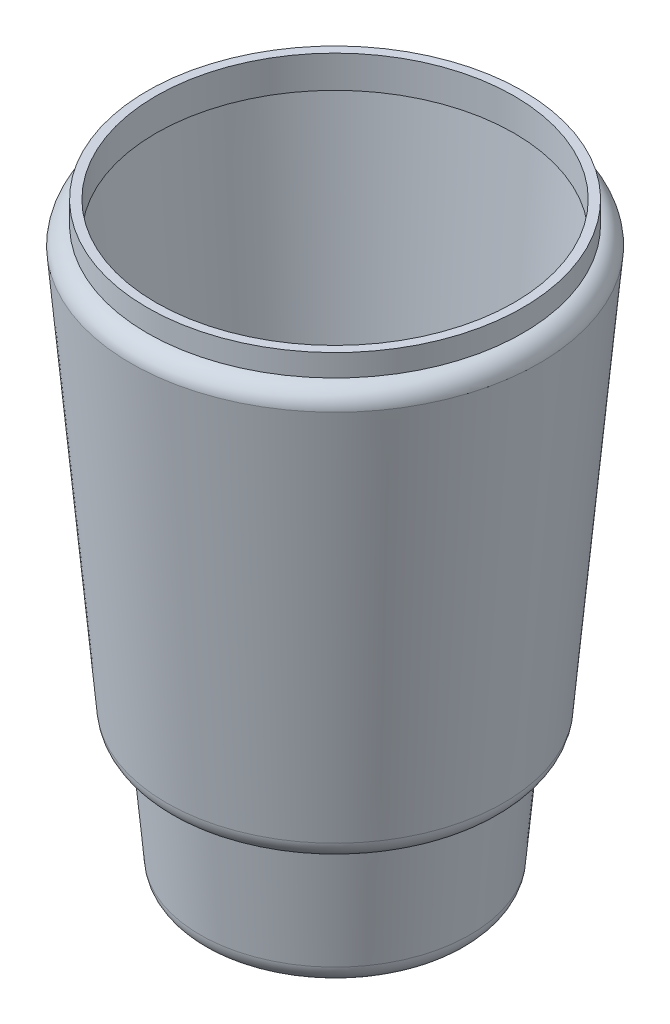
ISO-10303-21;
HEADER;
FILE_DESCRIPTION(('STEP AP214'),'2;1');
FILE_NAME('part.step','',(''),(''),'','','');
FILE_SCHEMA(('AUTOMOTIVE_DESIGN { 1 0 10303 214 1 1 1 1 }'));
ENDSEC;
DATA;
#1=APPLICATION_CONTEXT('core data for automotive mechanical design processes');
#2=APPLICATION_PROTOCOL_DEFINITION('international standard','automotive_design',2000,#1);
#3=PRODUCT_CONTEXT('',#1,'mechanical');
#4=PRODUCT('Part','Part','',(#3));
#5=PRODUCT_RELATED_PRODUCT_CATEGORY('part','',(#4));
#6=PRODUCT_DEFINITION_FORMATION('','',#4);
#7=PRODUCT_DEFINITION_CONTEXT('part definition',#1,'design');
#8=PRODUCT_DEFINITION('design','',#6,#7);
#9=PRODUCT_DEFINITION_SHAPE('','',#8);
#10=(LENGTH_UNIT() NAMED_UNIT(*) SI_UNIT(.MILLI.,.METRE.));
#11=(NAMED_UNIT(*) PLANE_ANGLE_UNIT() SI_UNIT($,.RADIAN.));
#12=(NAMED_UNIT(*) SI_UNIT($,.STERADIAN.) SOLID_ANGLE_UNIT());
#13=UNCERTAINTY_MEASURE_WITH_UNIT(LENGTH_MEASURE(1.E-05),#10,'distance_accuracy_value','');
#14=(GEOMETRIC_REPRESENTATION_CONTEXT(3) GLOBAL_UNCERTAINTY_ASSIGNED_CONTEXT((#13)) GLOBAL_UNIT_ASSIGNED_CONTEXT((#10,
#11,#12)) REPRESENTATION_CONTEXT('',''));
#15=CARTESIAN_POINT('',(0.,0.,0.));
#16=DIRECTION('',(0.,0.,1.));
#17=DIRECTION('',(1.,0.,0.));
#18=AXIS2_PLACEMENT_3D('',#15,#16,#17);
#19=CARTESIAN_POINT('',(0.,135.,-43.));
#20=DIRECTION('',(0.,1.,0.));
#21=DIRECTION('',(0.,0.,1.));
#22=AXIS2_PLACEMENT_3D('',#19,#20,#21);
#23=PLANE('',#22);
#24=CARTESIAN_POINT('',(0.,135.,0.));
#25=DIRECTION('',(0.,1.,0.));
#26=DIRECTION('',(0.,0.,1.));
#27=AXIS2_PLACEMENT_3D('',#24,#25,#26);
#28=CIRCLE('',#27,41.);
#29=CARTESIAN_POINT('',(0.,135.,41.));
#30=VERTEX_POINT('',#29);
#31=EDGE_CURVE('E88',#30,#30,#28,.F.);
#32=ORIENTED_EDGE('',*,*,#31,.T.);
#33=EDGE_LOOP('',(#32));
#34=FACE_BOUND('',#33,.T.);
#35=CARTESIAN_POINT('',(0.,135.,0.));
#36=DIRECTION('',(0.,-1.,0.));
#37=DIRECTION('',(0.,0.,-1.));
#38=AXIS2_PLACEMENT_3D('',#35,#36,#37);
#39=CIRCLE('',#38,43.);
#40=CARTESIAN_POINT('',(0.,135.,-43.));
#41=VERTEX_POINT('',#40);
#42=EDGE_CURVE('E10',#41,#41,#39,.T.);
#43=ORIENTED_EDGE('',*,*,#42,.F.);
#44=EDGE_LOOP('',(#43));
#45=FACE_BOUND('',#44,.T.);
#46=ADVANCED_FACE('F49',(#34,#45),#23,.T.);
#47=CARTESIAN_POINT('',(0.,0.,0.));
#48=DIRECTION('',(0.,-1.,0.));
#49=DIRECTION('',(0.,0.,-1.));
#50=AXIS2_PLACEMENT_3D('',#47,#48,#49);
#51=CYLINDRICAL_SURFACE('',#50,43.);
#52=ORIENTED_EDGE('',*,*,#42,.T.);
#53=EDGE_LOOP('',(#52));
#54=FACE_BOUND('',#53,.T.);
#55=CARTESIAN_POINT('',(0.,129.952018505343,0.));
#56=DIRECTION('',(0.,-1.,0.));
#57=DIRECTION('',(0.,0.,-1.));
#58=AXIS2_PLACEMENT_3D('',#55,#56,#57);
#59=CIRCLE('',#58,43.);
#60=CARTESIAN_POINT('',(0.,129.952018505343,-43.));
#61=VERTEX_POINT('',#60);
#62=EDGE_CURVE('E56',#61,#61,#59,.T.);
#63=ORIENTED_EDGE('',*,*,#62,.F.);
#64=EDGE_LOOP('',(#63));
#65=FACE_BOUND('',#64,.T.);
#66=ADVANCED_FACE('F166',(#54,#65),#51,.T.);
#67=CARTESIAN_POINT('',(0.,125.579924599252,0.));
#68=DIRECTION('',(0.,-1.,0.));
#69=DIRECTION('',(0.,0.,-1.));
#70=AXIS2_PLACEMENT_3D('',#67,#68,#69);
#71=TOROIDAL_SURFACE('',#70,42.312532080804,4.42581261053871);
#72=ORIENTED_EDGE('',*,*,#62,.T.);
#73=EDGE_LOOP('',(#72));
#74=FACE_BOUND('',#73,.T.);
#75=CARTESIAN_POINT('',(0.,125.805203793381,0.));
#76=DIRECTION('',(0.,-1.,0.));
#77=DIRECTION('',(0.,0.,-1.));
#78=AXIS2_PLACEMENT_3D('',#75,#76,#77);
#79=CIRCLE('',#78,46.7326074815519);
#80=CARTESIAN_POINT('',(0.,125.805203793381,-46.7326074815519));
#81=VERTEX_POINT('',#80);
#82=EDGE_CURVE('E61',#81,#81,#79,.T.);
#83=ORIENTED_EDGE('',*,*,#82,.F.);
#84=EDGE_LOOP('',(#83));
#85=FACE_BOUND('',#84,.T.);
#86=ADVANCED_FACE('F171',(#74,#85),#71,.T.);
#87=CARTESIAN_POINT('',(0.,34.5553403101275,0.));
#88=DIRECTION('',(0.,1.,0.));
#89=DIRECTION('',(0.,0.,1.));
#90=AXIS2_PLACEMENT_3D('',#87,#88,#89);
#91=CONICAL_SURFACE('',#90,38.5852982419757,0.0890495826344976);
#92=ORIENTED_EDGE('',*,*,#82,.T.);
#93=EDGE_LOOP('',(#92));
#94=FACE_BOUND('',#93,.T.);
#95=CARTESIAN_POINT('',(0.,34.5553403101275,0.));
#96=DIRECTION('',(0.,-1.,0.));
#97=DIRECTION('',(0.,0.,-1.));
#98=AXIS2_PLACEMENT_3D('',#95,#96,#97);
#99=CIRCLE('',#98,38.5852982419757);
#100=CARTESIAN_POINT('',(0.,34.5553403101275,-38.5852982419757));
#101=VERTEX_POINT('',#100);
#102=EDGE_CURVE('E66',#101,#101,#99,.T.);
#103=ORIENTED_EDGE('',*,*,#102,.F.);
#104=EDGE_LOOP('',(#103));
#105=FACE_BOUND('',#104,.T.);
#106=ADVANCED_FACE('F201',(#94,#105),#91,.T.);
#107=CARTESIAN_POINT('',(0.,35.,0.));
#108=DIRECTION('',(0.,-1.,0.));
#109=DIRECTION('',(0.,0.,-1.));
#110=AXIS2_PLACEMENT_3D('',#107,#108,#109);
#111=TOROIDAL_SURFACE('',#110,33.6051097154034,5.);
#112=ORIENTED_EDGE('',*,*,#102,.T.);
#113=EDGE_LOOP('',(#112));
#114=FACE_BOUND('',#113,.T.);
#115=CARTESIAN_POINT('',(0.,30.,0.));
#116=DIRECTION('',(0.,-1.,0.));
#117=DIRECTION('',(0.,0.,-1.));
#118=AXIS2_PLACEMENT_3D('',#115,#116,#117);
#119=CIRCLE('',#118,33.6051097154033);
#120=CARTESIAN_POINT('',(0.,30.,-33.6051097154033));
#121=VERTEX_POINT('',#120);
#122=EDGE_CURVE('E72',#121,#121,#119,.T.);
#123=ORIENTED_EDGE('',*,*,#122,.F.);
#124=EDGE_LOOP('',(#123));
#125=FACE_BOUND('',#124,.T.);
#126=ADVANCED_FACE('F197',(#114,#125),#111,.T.);
#127=CARTESIAN_POINT('',(0.,30.,-33.1785714285714));
#128=DIRECTION('',(0.,-1.,0.));
#129=DIRECTION('',(0.,0.,-1.));
#130=AXIS2_PLACEMENT_3D('',#127,#128,#129);
#131=PLANE('',#130);
#132=ORIENTED_EDGE('',*,*,#122,.T.);
#133=EDGE_LOOP('',(#132));
#134=FACE_BOUND('',#133,.T.);
#135=CARTESIAN_POINT('',(0.,30.,0.));
#136=DIRECTION('',(0.,-1.,0.));
#137=DIRECTION('',(0.,0.,-1.));
#138=AXIS2_PLACEMENT_3D('',#135,#136,#137);
#139=CIRCLE('',#138,33.1785714285714);
#140=CARTESIAN_POINT('',(0.,30.,-33.1785714285714));
#141=VERTEX_POINT('',#140);
#142=EDGE_CURVE('E76',#141,#141,#139,.T.);
#143=ORIENTED_EDGE('',*,*,#142,.F.);
#144=EDGE_LOOP('',(#143));
#145=FACE_BOUND('',#144,.T.);
#146=ADVANCED_FACE('F193',(#134,#145),#131,.T.);
#147=CARTESIAN_POINT('',(0.,4.5553403101275,0.));
#148=DIRECTION('',(0.,1.,0.));
#149=DIRECTION('',(0.,0.,1.));
#150=AXIS2_PLACEMENT_3D('',#147,#148,#149);
#151=CONICAL_SURFACE('',#150,30.9067268134042,0.0890495826344977);
#152=ORIENTED_EDGE('',*,*,#142,.T.);
#153=EDGE_LOOP('',(#152));
#154=FACE_BOUND('',#153,.T.);
#155=CARTESIAN_POINT('',(0.,4.5553403101275,0.));
#156=DIRECTION('',(0.,-1.,0.));
#157=DIRECTION('',(0.,0.,-1.));
#158=AXIS2_PLACEMENT_3D('',#155,#156,#157);
#159=CIRCLE('',#158,30.9067268134042);
#160=CARTESIAN_POINT('',(0.,4.5553403101275,-30.9067268134042));
#161=VERTEX_POINT('',#160);
#162=EDGE_CURVE('E80',#161,#161,#159,.T.);
#163=ORIENTED_EDGE('',*,*,#162,.F.);
#164=EDGE_LOOP('',(#163));
#165=FACE_BOUND('',#164,.T.);
#166=ADVANCED_FACE('F187',(#154,#165),#151,.T.);
#167=CARTESIAN_POINT('',(0.,5.,0.));
#168=DIRECTION('',(0.,-1.,0.));
#169=DIRECTION('',(0.,0.,-1.));
#170=AXIS2_PLACEMENT_3D('',#167,#168,#169);
#171=TOROIDAL_SURFACE('',#170,25.9265382868319,5.);
#172=ORIENTED_EDGE('',*,*,#162,.T.);
#173=EDGE_LOOP('',(#172));
#174=FACE_BOUND('',#173,.T.);
#175=CARTESIAN_POINT('',(0.,0.,0.));
#176=DIRECTION('',(0.,-1.,0.));
#177=DIRECTION('',(0.,0.,-1.));
#178=AXIS2_PLACEMENT_3D('',#175,#176,#177);
#179=CIRCLE('',#178,25.9265382868319);
#180=CARTESIAN_POINT('',(0.,0.,-25.9265382868319));
#181=VERTEX_POINT('',#180);
#182=EDGE_CURVE('E84',#181,#181,#179,.T.);
#183=ORIENTED_EDGE('',*,*,#182,.F.);
#184=EDGE_LOOP('',(#183));
#185=FACE_BOUND('',#184,.T.);
#186=ADVANCED_FACE('F182',(#174,#185),#171,.T.);
#187=CARTESIAN_POINT('',(0.,0.,0.));
#188=DIRECTION('',(0.,-1.,0.));
#189=DIRECTION('',(0.,0.,-1.));
#190=AXIS2_PLACEMENT_3D('',#187,#188,#189);
#191=PLANE('',#190);
#192=ORIENTED_EDGE('',*,*,#182,.T.);
#193=EDGE_LOOP('',(#192));
#194=FACE_BOUND('',#193,.T.);
#195=ADVANCED_FACE('F176',(#194),#191,.T.);
#196=CARTESIAN_POINT('',(0.,0.,0.));
#197=DIRECTION('',(0.,-1.,0.));
#198=DIRECTION('',(0.,0.,-1.));
#199=AXIS2_PLACEMENT_3D('',#196,#197,#198);
#200=CYLINDRICAL_SURFACE('',#199,41.);
#201=ORIENTED_EDGE('',*,*,#31,.F.);
#202=EDGE_LOOP('',(#201));
#203=FACE_BOUND('',#202,.T.);
#204=CARTESIAN_POINT('',(0.,127.619980078475,0.));
#205=DIRECTION('',(0.,-1.,0.));
#206=DIRECTION('',(0.,0.,-1.));
#207=AXIS2_PLACEMENT_3D('',#204,#205,#206);
#208=CIRCLE('',#207,41.);
#209=CARTESIAN_POINT('',(0.,127.619980078475,-41.));
#210=VERTEX_POINT('',#209);
#211=EDGE_CURVE('E92',#210,#210,#208,.T.);
#212=ORIENTED_EDGE('',*,*,#211,.T.);
#213=EDGE_LOOP('',(#212));
#214=FACE_BOUND('',#213,.T.);
#215=ADVANCED_FACE('F121',(#203,#214),#200,.F.);
#216=CARTESIAN_POINT('',(0.,125.579924599252,0.));
#217=DIRECTION('',(0.,-1.,0.));
#218=DIRECTION('',(0.,0.,-1.));
#219=AXIS2_PLACEMENT_3D('',#216,#217,#218);
#220=TOROIDAL_SURFACE('',#219,42.312532080804,2.42581261053871);
#221=ORIENTED_EDGE('',*,*,#211,.F.);
#222=EDGE_LOOP('',(#221));
#223=FACE_BOUND('',#222,.T.);
#224=CARTESIAN_POINT('',(0.,125.822447676096,0.));
#225=DIRECTION('',(0.,-1.,0.));
#226=DIRECTION('',(0.,0.,-1.));
#227=AXIS2_PLACEMENT_3D('',#224,#225,#226);
#228=CIRCLE('',#227,44.7261910000985);
#229=CARTESIAN_POINT('',(0.,125.822447676096,-44.7261910000985));
#230=VERTEX_POINT('',#229);
#231=EDGE_CURVE('E113',#230,#230,#228,.T.);
#232=ORIENTED_EDGE('',*,*,#231,.T.);
#233=EDGE_LOOP('',(#232));
#234=FACE_BOUND('',#233,.T.);
#235=ADVANCED_FACE('F123',(#223,#234),#220,.F.);
#236=CARTESIAN_POINT('',(0.,34.7332041860765,0.));
#237=DIRECTION('',(0.,1.,0.));
#238=DIRECTION('',(0.,0.,1.));
#239=AXIS2_PLACEMENT_3D('',#236,#237,#238);
#240=CONICAL_SURFACE('',#239,36.5932228313467,0.0890495826344976);
#241=ORIENTED_EDGE('',*,*,#231,.F.);
#242=EDGE_LOOP('',(#241));
#243=FACE_BOUND('',#242,.T.);
#244=CARTESIAN_POINT('',(0.,34.7332041860765,0.));
#245=DIRECTION('',(0.,-1.,0.));
#246=DIRECTION('',(0.,0.,-1.));
#247=AXIS2_PLACEMENT_3D('',#244,#245,#246);
#248=CIRCLE('',#247,36.5932228313467);
#249=CARTESIAN_POINT('',(0.,34.7332041860765,-36.5932228313467));
#250=VERTEX_POINT('',#249);
#251=EDGE_CURVE('E109',#250,#250,#248,.T.);
#252=ORIENTED_EDGE('',*,*,#251,.T.);
#253=EDGE_LOOP('',(#252));
#254=FACE_BOUND('',#253,.T.);
#255=ADVANCED_FACE('F126',(#243,#254),#240,.F.);
#256=CARTESIAN_POINT('',(0.,35.,0.));
#257=DIRECTION('',(0.,-1.,0.));
#258=DIRECTION('',(0.,0.,-1.));
#259=AXIS2_PLACEMENT_3D('',#256,#257,#258);
#260=TOROIDAL_SURFACE('',#259,33.6051097154034,3.);
#261=ORIENTED_EDGE('',*,*,#251,.F.);
#262=EDGE_LOOP('',(#261));
#263=FACE_BOUND('',#262,.T.);
#264=CARTESIAN_POINT('',(0.,32.,0.));
#265=DIRECTION('',(0.,-1.,0.));
#266=DIRECTION('',(0.,0.,-1.));
#267=AXIS2_PLACEMENT_3D('',#264,#265,#266);
#268=CIRCLE('',#267,33.6051097154033);
#269=CARTESIAN_POINT('',(0.,32.,-33.6051097154033));
#270=VERTEX_POINT('',#269);
#271=EDGE_CURVE('E105',#270,#270,#268,.T.);
#272=ORIENTED_EDGE('',*,*,#271,.T.);
#273=EDGE_LOOP('',(#272));
#274=FACE_BOUND('',#273,.T.);
#275=ADVANCED_FACE('F132',(#263,#274),#260,.F.);
#276=CARTESIAN_POINT('',(0.,32.,-33.1785714285714));
#277=DIRECTION('',(0.,-1.,0.));
#278=DIRECTION('',(0.,0.,-1.));
#279=AXIS2_PLACEMENT_3D('',#276,#277,#278);
#280=PLANE('',#279);
#281=ORIENTED_EDGE('',*,*,#271,.F.);
#282=EDGE_LOOP('',(#281));
#283=FACE_BOUND('',#282,.T.);
#284=CARTESIAN_POINT('',(0.,32.,0.));
#285=DIRECTION('',(0.,-1.,0.));
#286=DIRECTION('',(0.,0.,-1.));
#287=AXIS2_PLACEMENT_3D('',#284,#285,#286);
#288=CIRCLE('',#287,31.3491867433042);
#289=CARTESIAN_POINT('',(0.,32.,-31.3491867433042));
#290=VERTEX_POINT('',#289);
#291=EDGE_CURVE('E101',#290,#290,#288,.T.);
#292=ORIENTED_EDGE('',*,*,#291,.T.);
#293=EDGE_LOOP('',(#292));
#294=FACE_BOUND('',#293,.T.);
#295=ADVANCED_FACE('F138',(#283,#294),#280,.F.);
#296=CARTESIAN_POINT('',(0.,4.73320418607651,0.));
#297=DIRECTION('',(0.,1.,0.));
#298=DIRECTION('',(0.,0.,1.));
#299=AXIS2_PLACEMENT_3D('',#296,#297,#298);
#300=CONICAL_SURFACE('',#299,28.9146514027753,0.0890495826344977);
#301=ORIENTED_EDGE('',*,*,#291,.F.);
#302=EDGE_LOOP('',(#301));
#303=FACE_BOUND('',#302,.T.);
#304=CARTESIAN_POINT('',(0.,4.7332041860765,0.));
#305=DIRECTION('',(0.,-1.,0.));
#306=DIRECTION('',(0.,0.,-1.));
#307=AXIS2_PLACEMENT_3D('',#304,#305,#306);
#308=CIRCLE('',#307,28.9146514027753);
#309=CARTESIAN_POINT('',(0.,4.7332041860765,-28.9146514027753));
#310=VERTEX_POINT('',#309);
#311=EDGE_CURVE('E97',#310,#310,#308,.T.);
#312=ORIENTED_EDGE('',*,*,#311,.T.);
#313=EDGE_LOOP('',(#312));
#314=FACE_BOUND('',#313,.T.);
#315=ADVANCED_FACE('F144',(#303,#314),#300,.F.);
#316=CARTESIAN_POINT('',(0.,5.,0.));
#317=DIRECTION('',(0.,-1.,0.));
#318=DIRECTION('',(0.,0.,-1.));
#319=AXIS2_PLACEMENT_3D('',#316,#317,#318);
#320=TOROIDAL_SURFACE('',#319,25.9265382868319,3.);
#321=ORIENTED_EDGE('',*,*,#311,.F.);
#322=EDGE_LOOP('',(#321));
#323=FACE_BOUND('',#322,.T.);
#324=CARTESIAN_POINT('',(0.,2.,0.));
#325=DIRECTION('',(0.,-1.,0.));
#326=DIRECTION('',(0.,0.,-1.));
#327=AXIS2_PLACEMENT_3D('',#324,#325,#326);
#328=CIRCLE('',#327,25.9265382868319);
#329=CARTESIAN_POINT('',(0.,2.,-25.9265382868319));
#330=VERTEX_POINT('',#329);
#331=EDGE_CURVE('E93',#330,#330,#328,.T.);
#332=ORIENTED_EDGE('',*,*,#331,.T.);
#333=EDGE_LOOP('',(#332));
#334=FACE_BOUND('',#333,.T.);
#335=ADVANCED_FACE('F150',(#323,#334),#320,.F.);
#336=CARTESIAN_POINT('',(0.,2.,0.));
#337=DIRECTION('',(0.,-1.,0.));
#338=DIRECTION('',(0.,0.,-1.));
#339=AXIS2_PLACEMENT_3D('',#336,#337,#338);
#340=PLANE('',#339);
#341=ORIENTED_EDGE('',*,*,#331,.F.);
#342=EDGE_LOOP('',(#341));
#343=FACE_BOUND('',#342,.T.);
#344=ADVANCED_FACE('F156',(#343),#340,.F.);
#345=CLOSED_SHELL('',(#46,#66,#86,#106,#126,#146,#166,#186,#195,#215,#235,#255,#275,#295,#315,
#335,#344));
#346=MANIFOLD_SOLID_BREP('B2',#345);
#347=ADVANCED_BREP_SHAPE_REPRESENTATION('',(#18,#346),#14);
#348=SHAPE_DEFINITION_REPRESENTATION(#9,#347);
ENDSEC;
END-ISO-10303-21;
